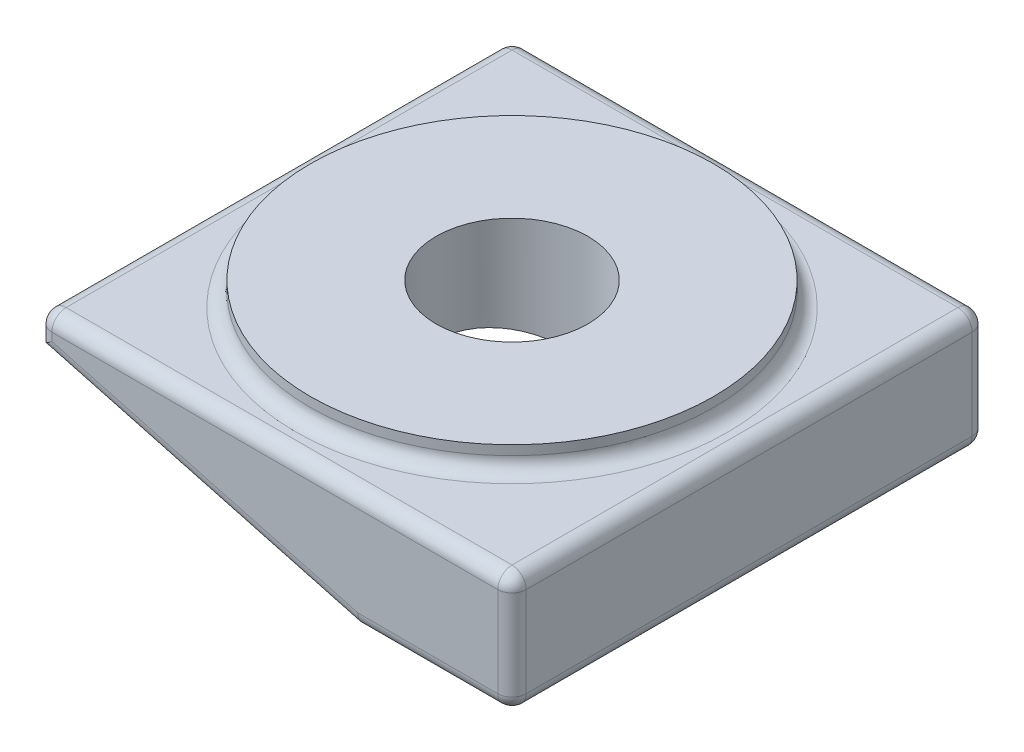
ISO-10303-21;
HEADER;
FILE_DESCRIPTION(('STEP AP214'),'2;1');
FILE_NAME('part.step','',(''),(''),'','','');
FILE_SCHEMA(('AUTOMOTIVE_DESIGN { 1 0 10303 214 1 1 1 1 }'));
ENDSEC;
DATA;
#1=APPLICATION_CONTEXT('core data for automotive mechanical design processes');
#2=APPLICATION_PROTOCOL_DEFINITION('international standard','automotive_design',2000,#1);
#3=PRODUCT_CONTEXT('',#1,'mechanical');
#4=PRODUCT('Part','Part','',(#3));
#5=PRODUCT_RELATED_PRODUCT_CATEGORY('part','',(#4));
#6=PRODUCT_DEFINITION_FORMATION('','',#4);
#7=PRODUCT_DEFINITION_CONTEXT('part definition',#1,'design');
#8=PRODUCT_DEFINITION('design','',#6,#7);
#9=PRODUCT_DEFINITION_SHAPE('','',#8);
#10=(LENGTH_UNIT() NAMED_UNIT(*) SI_UNIT(.MILLI.,.METRE.));
#11=(NAMED_UNIT(*) PLANE_ANGLE_UNIT() SI_UNIT($,.RADIAN.));
#12=(NAMED_UNIT(*) SI_UNIT($,.STERADIAN.) SOLID_ANGLE_UNIT());
#13=UNCERTAINTY_MEASURE_WITH_UNIT(LENGTH_MEASURE(1.E-05),#10,'distance_accuracy_value','');
#14=(GEOMETRIC_REPRESENTATION_CONTEXT(3) GLOBAL_UNCERTAINTY_ASSIGNED_CONTEXT((#13)) GLOBAL_UNIT_ASSIGNED_CONTEXT((#10,
#11,#12)) REPRESENTATION_CONTEXT('',''));
#15=CARTESIAN_POINT('',(0.,0.,0.));
#16=DIRECTION('',(0.,0.,1.));
#17=DIRECTION('',(1.,0.,0.));
#18=AXIS2_PLACEMENT_3D('',#15,#16,#17);
#19=CARTESIAN_POINT('',(-100.,18.,50.));
#20=DIRECTION('',(0.258819045102514,0.96592582628907,0.));
#21=DIRECTION('',(-0.96592582628907,0.258819045102514,0.));
#22=AXIS2_PLACEMENT_3D('',#19,#20,#21);
#23=PLANE('',#22);
#24=DIRECTION('',(0.,0.,-1.));
#25=VECTOR('',#24,1.);
#26=CARTESIAN_POINT('',(-32.8230854637585,0.,50.));
#27=LINE('',#26,#25);
#28=CARTESIAN_POINT('',(-32.8230854637585,0.,47.));
#29=VERTEX_POINT('',#28);
#30=CARTESIAN_POINT('',(-32.8230854637585,0.,46.));
#31=VERTEX_POINT('',#30);
#32=EDGE_CURVE('E181',#29,#31,#27,.T.);
#33=ORIENTED_EDGE('',*,*,#32,.F.);
#34=DIRECTION('',(0.96592582628907,-0.258819045102514,0.));
#35=VECTOR('',#34,1.);
#36=CARTESIAN_POINT('',(-100.,18.,47.));
#37=LINE('',#36,#35);
#38=CARTESIAN_POINT('',(-100.,18.,47.));
#39=VERTEX_POINT('',#38);
#40=EDGE_CURVE('E44',#29,#39,#37,.F.);
#41=ORIENTED_EDGE('',*,*,#40,.T.);
#42=DIRECTION('',(0.,0.,-1.));
#43=VECTOR('',#42,1.);
#44=CARTESIAN_POINT('',(-100.,18.,50.));
#45=LINE('',#44,#43);
#46=CARTESIAN_POINT('',(-100.,18.,46.));
#47=VERTEX_POINT('',#46);
#48=EDGE_CURVE('E190',#39,#47,#45,.T.);
#49=ORIENTED_EDGE('',*,*,#48,.T.);
#50=DIRECTION('',(-0.96592582628907,0.258819045102514,0.));
#51=VECTOR('',#50,1.);
#52=CARTESIAN_POINT('',(-111.308472893322,21.0300961793947,46.));
#53=LINE('',#52,#51);
#54=EDGE_CURVE('E166',#31,#47,#53,.T.);
#55=ORIENTED_EDGE('',*,*,#54,.F.);
#56=EDGE_LOOP('',(#33,#41,#49,#55));
#57=FACE_BOUND('',#56,.T.);
#58=ADVANCED_FACE('F35',(#57),#23,.F.);
#59=CARTESIAN_POINT('',(-50.,30.,0.));
#60=DIRECTION('',(0.,-1.,0.));
#61=DIRECTION('',(1.,0.,0.));
#62=AXIS2_PLACEMENT_3D('',#59,#60,#61);
#63=CYLINDRICAL_SURFACE('',#62,16.);
#64=CARTESIAN_POINT('',(-50.,30.,0.));
#65=DIRECTION('',(0.,1.,0.));
#66=DIRECTION('',(-1.,0.,0.));
#67=AXIS2_PLACEMENT_3D('',#64,#65,#66);
#68=CIRCLE('',#67,16.);
#69=CARTESIAN_POINT('',(-66.,30.,0.));
#70=VERTEX_POINT('',#69);
#71=EDGE_CURVE('E186',#70,#70,#68,.T.);
#72=ORIENTED_EDGE('',*,*,#71,.T.);
#73=EDGE_LOOP('',(#72));
#74=FACE_BOUND('',#73,.T.);
#75=CARTESIAN_POINT('',(-50.,6.67309273926437,0.));
#76=DIRECTION('',(-0.258819045102514,-0.96592582628907,0.));
#77=DIRECTION('',(0.96592582628907,-0.258819045102514,0.));
#78=AXIS2_PLACEMENT_3D('',#75,#76,#77);
#79=ELLIPSE('',#78,16.5644188865613,16.);
#80=CARTESIAN_POINT('',(-34.,2.38590566036652,0.));
#81=VERTEX_POINT('',#80);
#82=EDGE_CURVE('E193',#81,#81,#79,.T.);
#83=ORIENTED_EDGE('',*,*,#82,.T.);
#84=EDGE_LOOP('',(#83));
#85=FACE_BOUND('',#84,.T.);
#86=ADVANCED_FACE('F396',(#74,#85),#63,.F.);
#87=CARTESIAN_POINT('',(-32.8230854637585,0.,50.));
#88=DIRECTION('',(0.,1.,0.));
#89=DIRECTION('',(-1.,0.,0.));
#90=AXIS2_PLACEMENT_3D('',#87,#88,#89);
#91=PLANE('',#90);
#92=CARTESIAN_POINT('',(-32.8230854637585,0.,-46.));
#93=VERTEX_POINT('',#92);
#94=CARTESIAN_POINT('',(-32.8230854637585,0.,-47.));
#95=VERTEX_POINT('',#94);
#96=EDGE_CURVE('E172',#93,#95,#27,.T.);
#97=ORIENTED_EDGE('',*,*,#96,.T.);
#98=DIRECTION('',(1.,0.,0.));
#99=VECTOR('',#98,1.);
#100=CARTESIAN_POINT('',(-32.8230854637585,0.,-47.));
#101=LINE('',#100,#99);
#102=CARTESIAN_POINT('',(-3.,0.,-47.));
#103=VERTEX_POINT('',#102);
#104=EDGE_CURVE('E243',#95,#103,#101,.T.);
#105=ORIENTED_EDGE('',*,*,#104,.T.);
#106=DIRECTION('',(0.,0.,-1.));
#107=VECTOR('',#106,1.);
#108=CARTESIAN_POINT('',(-3.,0.,50.));
#109=LINE('',#108,#107);
#110=CARTESIAN_POINT('',(-3.,0.,47.));
#111=VERTEX_POINT('',#110);
#112=EDGE_CURVE('E241',#103,#111,#109,.F.);
#113=ORIENTED_EDGE('',*,*,#112,.T.);
#114=DIRECTION('',(1.,0.,0.));
#115=VECTOR('',#114,1.);
#116=CARTESIAN_POINT('',(-32.8230854637585,0.,47.));
#117=LINE('',#116,#115);
#118=EDGE_CURVE('E239',#111,#29,#117,.F.);
#119=ORIENTED_EDGE('',*,*,#118,.T.);
#120=ORIENTED_EDGE('',*,*,#32,.T.);
#121=DIRECTION('',(1.,0.,0.));
#122=VECTOR('',#121,1.);
#123=CARTESIAN_POINT('',(-32.8230854637585,0.,46.));
#124=LINE('',#123,#122);
#125=CARTESIAN_POINT('',(-25.0956788534457,0.,46.));
#126=VERTEX_POINT('',#125);
#127=EDGE_CURVE('E689',#31,#126,#124,.T.);
#128=ORIENTED_EDGE('',*,*,#127,.T.);
#129=DIRECTION('',(0.,0.,1.));
#130=VECTOR('',#129,1.);
#131=CARTESIAN_POINT('',(-25.0956788534457,0.,50.));
#132=LINE('',#131,#130);
#133=CARTESIAN_POINT('',(-25.0956788534457,0.,-46.));
#134=VERTEX_POINT('',#133);
#135=EDGE_CURVE('E175',#134,#126,#132,.T.);
#136=ORIENTED_EDGE('',*,*,#135,.F.);
#137=DIRECTION('',(-1.,0.,0.));
#138=VECTOR('',#137,1.);
#139=CARTESIAN_POINT('',(-32.8230854637585,0.,-46.));
#140=LINE('',#139,#138);
#141=EDGE_CURVE('E158',#134,#93,#140,.T.);
#142=ORIENTED_EDGE('',*,*,#141,.T.);
#143=EDGE_LOOP('',(#97,#105,#113,#119,#120,#128,#136,#142));
#144=FACE_BOUND('',#143,.T.);
#145=ADVANCED_FACE('F171',(#144),#91,.F.);
#146=CARTESIAN_POINT('',(0.,0.,50.));
#147=DIRECTION('',(-1.,0.,0.));
#148=DIRECTION('',(0.,0.,1.));
#149=AXIS2_PLACEMENT_3D('',#146,#147,#148);
#150=PLANE('',#149);
#151=DIRECTION('',(0.,0.,-1.));
#152=VECTOR('',#151,1.);
#153=CARTESIAN_POINT('',(0.,3.,50.));
#154=LINE('',#153,#152);
#155=CARTESIAN_POINT('',(0.,3.,47.));
#156=VERTEX_POINT('',#155);
#157=CARTESIAN_POINT('',(0.,3.,-47.));
#158=VERTEX_POINT('',#157);
#159=EDGE_CURVE('E52',#156,#158,#154,.T.);
#160=ORIENTED_EDGE('',*,*,#159,.T.);
#161=DIRECTION('',(0.,1.,0.));
#162=VECTOR('',#161,1.);
#163=CARTESIAN_POINT('',(0.,0.,-47.));
#164=LINE('',#163,#162);
#165=CARTESIAN_POINT('',(0.,22.,-47.));
#166=VERTEX_POINT('',#165);
#167=EDGE_CURVE('E249',#158,#166,#164,.T.);
#168=ORIENTED_EDGE('',*,*,#167,.T.);
#169=DIRECTION('',(0.,0.,-1.));
#170=VECTOR('',#169,1.);
#171=CARTESIAN_POINT('',(0.,22.,50.));
#172=LINE('',#171,#170);
#173=CARTESIAN_POINT('',(0.,22.,47.));
#174=VERTEX_POINT('',#173);
#175=EDGE_CURVE('E245',#166,#174,#172,.F.);
#176=ORIENTED_EDGE('',*,*,#175,.T.);
#177=DIRECTION('',(0.,1.,0.));
#178=VECTOR('',#177,1.);
#179=CARTESIAN_POINT('',(0.,0.,47.));
#180=LINE('',#179,#178);
#181=EDGE_CURVE('E57',#174,#156,#180,.F.);
#182=ORIENTED_EDGE('',*,*,#181,.T.);
#183=EDGE_LOOP('',(#160,#168,#176,#182));
#184=FACE_BOUND('',#183,.T.);
#185=ADVANCED_FACE('F417',(#184),#150,.F.);
#186=CARTESIAN_POINT('',(0.,25.,50.));
#187=DIRECTION('',(0.,-1.,0.));
#188=DIRECTION('',(1.,0.,0.));
#189=AXIS2_PLACEMENT_3D('',#186,#187,#188);
#190=PLANE('',#189);
#191=DIRECTION('',(-1.,0.,0.));
#192=VECTOR('',#191,1.);
#193=CARTESIAN_POINT('',(0.,25.,-47.));
#194=LINE('',#193,#192);
#195=CARTESIAN_POINT('',(-3.,25.,-47.));
#196=VERTEX_POINT('',#195);
#197=CARTESIAN_POINT('',(-97.,25.,-47.));
#198=VERTEX_POINT('',#197);
#199=EDGE_CURVE('E222',#196,#198,#194,.T.);
#200=ORIENTED_EDGE('',*,*,#199,.T.);
#201=DIRECTION('',(0.,0.,-1.));
#202=VECTOR('',#201,1.);
#203=CARTESIAN_POINT('',(-97.,25.,50.));
#204=LINE('',#203,#202);
#205=CARTESIAN_POINT('',(-97.,25.,47.));
#206=VERTEX_POINT('',#205);
#207=EDGE_CURVE('E224',#198,#206,#204,.F.);
#208=ORIENTED_EDGE('',*,*,#207,.T.);
#209=DIRECTION('',(-1.,0.,0.));
#210=VECTOR('',#209,1.);
#211=CARTESIAN_POINT('',(0.,25.,47.));
#212=LINE('',#211,#210);
#213=CARTESIAN_POINT('',(-3.,25.,47.));
#214=VERTEX_POINT('',#213);
#215=EDGE_CURVE('E218',#206,#214,#212,.F.);
#216=ORIENTED_EDGE('',*,*,#215,.T.);
#217=DIRECTION('',(0.,0.,-1.));
#218=VECTOR('',#217,1.);
#219=CARTESIAN_POINT('',(-3.,25.,50.));
#220=LINE('',#219,#218);
#221=EDGE_CURVE('E220',#214,#196,#220,.T.);
#222=ORIENTED_EDGE('',*,*,#221,.T.);
#223=EDGE_LOOP('',(#200,#208,#216,#222));
#224=FACE_BOUND('',#223,.T.);
#225=CARTESIAN_POINT('',(-50.,25.,0.));
#226=DIRECTION('',(0.,-1.,0.));
#227=DIRECTION('',(1.,0.,0.));
#228=AXIS2_PLACEMENT_3D('',#225,#226,#227);
#229=CIRCLE('',#228,45.5);
#230=CARTESIAN_POINT('',(-4.50000000000001,25.,0.));
#231=VERTEX_POINT('',#230);
#232=EDGE_CURVE('E215',#231,#231,#229,.T.);
#233=ORIENTED_EDGE('',*,*,#232,.T.);
#234=EDGE_LOOP('',(#233));
#235=FACE_BOUND('',#234,.T.);
#236=ADVANCED_FACE('F413',(#224,#235),#190,.F.);
#237=CARTESIAN_POINT('',(-100.,25.,50.));
#238=DIRECTION('',(1.,0.,0.));
#239=DIRECTION('',(0.,0.,-1.));
#240=AXIS2_PLACEMENT_3D('',#237,#238,#239);
#241=PLANE('',#240);
#242=ORIENTED_EDGE('',*,*,#48,.F.);
#243=DIRECTION('',(0.,-1.,0.));
#244=VECTOR('',#243,1.);
#245=CARTESIAN_POINT('',(-100.,25.,47.));
#246=LINE('',#245,#244);
#247=CARTESIAN_POINT('',(-100.,22.,47.));
#248=VERTEX_POINT('',#247);
#249=EDGE_CURVE('E212',#39,#248,#246,.F.);
#250=ORIENTED_EDGE('',*,*,#249,.T.);
#251=DIRECTION('',(0.,0.,-1.));
#252=VECTOR('',#251,1.);
#253=CARTESIAN_POINT('',(-100.,22.,50.));
#254=LINE('',#253,#252);
#255=CARTESIAN_POINT('',(-100.,22.,-47.));
#256=VERTEX_POINT('',#255);
#257=EDGE_CURVE('E210',#248,#256,#254,.T.);
#258=ORIENTED_EDGE('',*,*,#257,.T.);
#259=DIRECTION('',(0.,-1.,0.));
#260=VECTOR('',#259,1.);
#261=CARTESIAN_POINT('',(-100.,25.,-47.));
#262=LINE('',#261,#260);
#263=CARTESIAN_POINT('',(-100.,18.,-47.));
#264=VERTEX_POINT('',#263);
#265=EDGE_CURVE('E208',#256,#264,#262,.T.);
#266=ORIENTED_EDGE('',*,*,#265,.T.);
#267=CARTESIAN_POINT('',(-100.,18.,-46.));
#268=VERTEX_POINT('',#267);
#269=EDGE_CURVE('E184',#268,#264,#45,.T.);
#270=ORIENTED_EDGE('',*,*,#269,.F.);
#271=DIRECTION('',(0.,1.,0.));
#272=VECTOR('',#271,1.);
#273=CARTESIAN_POINT('',(-100.,25.,-46.));
#274=LINE('',#273,#272);
#275=CARTESIAN_POINT('',(-100.,20.0705523608202,-46.));
#276=VERTEX_POINT('',#275);
#277=EDGE_CURVE('E161',#268,#276,#274,.T.);
#278=ORIENTED_EDGE('',*,*,#277,.T.);
#279=DIRECTION('',(0.,0.,-1.));
#280=VECTOR('',#279,1.);
#281=CARTESIAN_POINT('',(-100.,20.0705523608201,50.));
#282=LINE('',#281,#280);
#283=CARTESIAN_POINT('',(-100.,20.0705523608202,46.));
#284=VERTEX_POINT('',#283);
#285=EDGE_CURVE('E196',#284,#276,#282,.T.);
#286=ORIENTED_EDGE('',*,*,#285,.F.);
#287=DIRECTION('',(0.,-1.,0.));
#288=VECTOR('',#287,1.);
#289=CARTESIAN_POINT('',(-100.,25.,46.));
#290=LINE('',#289,#288);
#291=EDGE_CURVE('E176',#284,#47,#290,.T.);
#292=ORIENTED_EDGE('',*,*,#291,.T.);
#293=EDGE_LOOP('',(#242,#250,#258,#266,#270,#278,#286,#292));
#294=FACE_BOUND('',#293,.T.);
#295=ADVANCED_FACE('F351',(#294),#241,.F.);
#296=ORIENTED_EDGE('',*,*,#269,.T.);
#297=DIRECTION('',(0.96592582628907,-0.258819045102514,0.));
#298=VECTOR('',#297,1.);
#299=CARTESIAN_POINT('',(-100.,18.,-47.));
#300=LINE('',#299,#298);
#301=EDGE_CURVE('E180',#264,#95,#300,.T.);
#302=ORIENTED_EDGE('',*,*,#301,.T.);
#303=ORIENTED_EDGE('',*,*,#96,.F.);
#304=DIRECTION('',(0.96592582628907,-0.258819045102514,0.));
#305=VECTOR('',#304,1.);
#306=CARTESIAN_POINT('',(-111.308472893322,21.0300961793947,-46.));
#307=LINE('',#306,#305);
#308=EDGE_CURVE('E154',#268,#93,#307,.T.);
#309=ORIENTED_EDGE('',*,*,#308,.F.);
#310=EDGE_LOOP('',(#296,#302,#303,#309));
#311=FACE_BOUND('',#310,.T.);
#312=ADVANCED_FACE('F178',(#311),#23,.F.);
#313=CARTESIAN_POINT('',(0.,0.,50.));
#314=DIRECTION('',(0.,0.,1.));
#315=DIRECTION('',(1.,0.,0.));
#316=AXIS2_PLACEMENT_3D('',#313,#314,#315);
#317=PLANE('',#316);
#318=DIRECTION('',(0.96592582628907,-0.258819045102514,0.));
#319=VECTOR('',#318,1.);
#320=CARTESIAN_POINT('',(-32.0466283284509,2.89777747886721,50.));
#321=LINE('',#320,#319);
#322=CARTESIAN_POINT('',(-97.,20.3019809639369,50.));
#323=VERTEX_POINT('',#322);
#324=CARTESIAN_POINT('',(-32.4281279709963,3.,50.));
#325=VERTEX_POINT('',#324);
#326=EDGE_CURVE('E204',#323,#325,#321,.T.);
#327=ORIENTED_EDGE('',*,*,#326,.T.);
#328=DIRECTION('',(1.,0.,0.));
#329=VECTOR('',#328,1.);
#330=CARTESIAN_POINT('',(0.,3.,50.));
#331=LINE('',#330,#329);
#332=CARTESIAN_POINT('',(-3.,3.,50.));
#333=VERTEX_POINT('',#332);
#334=EDGE_CURVE('E206',#325,#333,#331,.T.);
#335=ORIENTED_EDGE('',*,*,#334,.T.);
#336=DIRECTION('',(0.,1.,0.));
#337=VECTOR('',#336,1.);
#338=CARTESIAN_POINT('',(-3.,25.,50.));
#339=LINE('',#338,#337);
#340=CARTESIAN_POINT('',(-3.,22.,50.));
#341=VERTEX_POINT('',#340);
#342=EDGE_CURVE('E199',#333,#341,#339,.T.);
#343=ORIENTED_EDGE('',*,*,#342,.T.);
#344=DIRECTION('',(-1.,0.,0.));
#345=VECTOR('',#344,1.);
#346=CARTESIAN_POINT('',(-100.,22.,50.));
#347=LINE('',#346,#345);
#348=CARTESIAN_POINT('',(-97.,22.,50.));
#349=VERTEX_POINT('',#348);
#350=EDGE_CURVE('E192',#341,#349,#347,.T.);
#351=ORIENTED_EDGE('',*,*,#350,.T.);
#352=DIRECTION('',(0.,-1.,0.));
#353=VECTOR('',#352,1.);
#354=CARTESIAN_POINT('',(-97.,18.,50.));
#355=LINE('',#354,#353);
#356=EDGE_CURVE('E201',#349,#323,#355,.T.);
#357=ORIENTED_EDGE('',*,*,#356,.T.);
#358=EDGE_LOOP('',(#327,#335,#343,#351,#357));
#359=FACE_BOUND('',#358,.T.);
#360=ADVANCED_FACE('F406',(#359),#317,.T.);
#361=CARTESIAN_POINT('',(0.,0.,-50.));
#362=DIRECTION('',(0.,0.,1.));
#363=DIRECTION('',(1.,0.,0.));
#364=AXIS2_PLACEMENT_3D('',#361,#362,#363);
#365=PLANE('',#364);
#366=DIRECTION('',(0.96592582628907,-0.258819045102514,0.));
#367=VECTOR('',#366,1.);
#368=CARTESIAN_POINT('',(-1.4222726754703,-5.30799388707222,-50.));
#369=LINE('',#368,#367);
#370=CARTESIAN_POINT('',(-32.4281279709963,3.,-50.));
#371=VERTEX_POINT('',#370);
#372=CARTESIAN_POINT('',(-97.,20.3019809639369,-50.));
#373=VERTEX_POINT('',#372);
#374=EDGE_CURVE('E231',#371,#373,#369,.F.);
#375=ORIENTED_EDGE('',*,*,#374,.T.);
#376=DIRECTION('',(0.,-1.,0.));
#377=VECTOR('',#376,1.);
#378=CARTESIAN_POINT('',(-97.,0.,-50.));
#379=LINE('',#378,#377);
#380=CARTESIAN_POINT('',(-97.,22.,-50.));
#381=VERTEX_POINT('',#380);
#382=EDGE_CURVE('E235',#373,#381,#379,.F.);
#383=ORIENTED_EDGE('',*,*,#382,.T.);
#384=DIRECTION('',(-1.,0.,0.));
#385=VECTOR('',#384,1.);
#386=CARTESIAN_POINT('',(0.,22.,-50.));
#387=LINE('',#386,#385);
#388=CARTESIAN_POINT('',(-3.,22.,-50.));
#389=VERTEX_POINT('',#388);
#390=EDGE_CURVE('E233',#381,#389,#387,.F.);
#391=ORIENTED_EDGE('',*,*,#390,.T.);
#392=DIRECTION('',(0.,1.,0.));
#393=VECTOR('',#392,1.);
#394=CARTESIAN_POINT('',(-3.,0.,-50.));
#395=LINE('',#394,#393);
#396=CARTESIAN_POINT('',(-3.,3.,-50.));
#397=VERTEX_POINT('',#396);
#398=EDGE_CURVE('E227',#389,#397,#395,.F.);
#399=ORIENTED_EDGE('',*,*,#398,.T.);
#400=DIRECTION('',(1.,0.,0.));
#401=VECTOR('',#400,1.);
#402=CARTESIAN_POINT('',(0.,3.,-50.));
#403=LINE('',#402,#401);
#404=EDGE_CURVE('E229',#397,#371,#403,.F.);
#405=ORIENTED_EDGE('',*,*,#404,.T.);
#406=EDGE_LOOP('',(#375,#383,#391,#399,#405));
#407=FACE_BOUND('',#406,.T.);
#408=ADVANCED_FACE('F381',(#407),#365,.F.);
#409=CARTESIAN_POINT('',(-50.,30.,0.));
#410=DIRECTION('',(0.,1.,0.));
#411=DIRECTION('',(-1.,0.,0.));
#412=AXIS2_PLACEMENT_3D('',#409,#410,#411);
#413=PLANE('',#412);
#414=CARTESIAN_POINT('',(-50.,30.,0.));
#415=DIRECTION('',(0.,1.,0.));
#416=DIRECTION('',(-1.,0.,0.));
#417=AXIS2_PLACEMENT_3D('',#414,#415,#416);
#418=CIRCLE('',#417,42.5);
#419=CARTESIAN_POINT('',(-92.5,30.,0.));
#420=VERTEX_POINT('',#419);
#421=EDGE_CURVE('E182',#420,#420,#418,.T.);
#422=ORIENTED_EDGE('',*,*,#421,.T.);
#423=EDGE_LOOP('',(#422));
#424=FACE_BOUND('',#423,.T.);
#425=ORIENTED_EDGE('',*,*,#71,.F.);
#426=EDGE_LOOP('',(#425));
#427=FACE_BOUND('',#426,.T.);
#428=ADVANCED_FACE('F622',(#424,#427),#413,.T.);
#429=CARTESIAN_POINT('',(-50.,30.,0.));
#430=DIRECTION('',(0.,-1.,0.));
#431=DIRECTION('',(1.,0.,0.));
#432=AXIS2_PLACEMENT_3D('',#429,#430,#431);
#433=CYLINDRICAL_SURFACE('',#432,42.5);
#434=CARTESIAN_POINT('',(-50.,28.,0.));
#435=DIRECTION('',(0.,-1.,0.));
#436=DIRECTION('',(1.,0.,0.));
#437=AXIS2_PLACEMENT_3D('',#434,#435,#436);
#438=CIRCLE('',#437,42.5);
#439=CARTESIAN_POINT('',(-7.50000000000001,28.,0.));
#440=VERTEX_POINT('',#439);
#441=EDGE_CURVE('E11',#440,#440,#438,.F.);
#442=ORIENTED_EDGE('',*,*,#441,.T.);
#443=EDGE_LOOP('',(#442));
#444=FACE_BOUND('',#443,.T.);
#445=ORIENTED_EDGE('',*,*,#421,.F.);
#446=EDGE_LOOP('',(#445));
#447=FACE_BOUND('',#446,.T.);
#448=ADVANCED_FACE('F603',(#444,#447),#433,.T.);
#449=CARTESIAN_POINT('',(-110.790834803117,22.9619478319729,46.));
#450=DIRECTION('',(0.,0.,1.));
#451=DIRECTION('',(1.,0.,0.));
#452=AXIS2_PLACEMENT_3D('',#449,#450,#451);
#453=PLANE('',#452);
#454=ORIENTED_EDGE('',*,*,#54,.T.);
#455=ORIENTED_EDGE('',*,*,#291,.F.);
#456=DIRECTION('',(-0.96592582628907,0.258819045102514,0.));
#457=VECTOR('',#456,1.);
#458=CARTESIAN_POINT('',(-110.790834803117,22.9619478319729,46.));
#459=LINE('',#458,#457);
#460=EDGE_CURVE('E197',#126,#284,#459,.T.);
#461=ORIENTED_EDGE('',*,*,#460,.F.);
#462=ORIENTED_EDGE('',*,*,#127,.F.);
#463=EDGE_LOOP('',(#454,#455,#461,#462));
#464=FACE_BOUND('',#463,.T.);
#465=ADVANCED_FACE('F595',(#464),#453,.F.);
#466=CARTESIAN_POINT('',(-110.790834803117,22.9619478319729,-46.));
#467=DIRECTION('',(0.,0.,-1.));
#468=DIRECTION('',(-1.,0.,0.));
#469=AXIS2_PLACEMENT_3D('',#466,#467,#468);
#470=PLANE('',#469);
#471=DIRECTION('',(0.96592582628907,-0.258819045102514,0.));
#472=VECTOR('',#471,1.);
#473=CARTESIAN_POINT('',(-110.790834803117,22.9619478319729,-46.));
#474=LINE('',#473,#472);
#475=EDGE_CURVE('E696',#276,#134,#474,.T.);
#476=ORIENTED_EDGE('',*,*,#475,.F.);
#477=ORIENTED_EDGE('',*,*,#277,.F.);
#478=ORIENTED_EDGE('',*,*,#308,.T.);
#479=ORIENTED_EDGE('',*,*,#141,.F.);
#480=EDGE_LOOP('',(#476,#477,#478,#479));
#481=FACE_BOUND('',#480,.T.);
#482=ADVANCED_FACE('F157',(#481),#470,.F.);
#483=CARTESIAN_POINT('',(-1.68109172057281,-6.27391971336129,0.));
#484=DIRECTION('',(-0.258819045102514,-0.96592582628907,0.));
#485=DIRECTION('',(0.96592582628907,-0.258819045102514,0.));
#486=AXIS2_PLACEMENT_3D('',#483,#484,#485);
#487=PLANE('',#486);
#488=ORIENTED_EDGE('',*,*,#82,.F.);
#489=EDGE_LOOP('',(#488));
#490=FACE_BOUND('',#489,.T.);
#491=ORIENTED_EDGE('',*,*,#135,.T.);
#492=ORIENTED_EDGE('',*,*,#460,.T.);
#493=ORIENTED_EDGE('',*,*,#285,.T.);
#494=ORIENTED_EDGE('',*,*,#475,.T.);
#495=EDGE_LOOP('',(#491,#492,#493,#494));
#496=FACE_BOUND('',#495,.T.);
#497=ADVANCED_FACE('F579',(#490,#496),#487,.T.);
#498=CARTESIAN_POINT('',(-3.,0.,-47.));
#499=DIRECTION('',(0.,1.,0.));
#500=DIRECTION('',(0.,0.,1.));
#501=AXIS2_PLACEMENT_3D('',#498,#499,#500);
#502=CYLINDRICAL_SURFACE('',#501,3.);
#503=CARTESIAN_POINT('',(-3.,3.,-47.));
#504=DIRECTION('',(0.,-1.,0.));
#505=DIRECTION('',(0.,0.,-1.));
#506=AXIS2_PLACEMENT_3D('',#503,#504,#505);
#507=CIRCLE('',#506,3.);
#508=EDGE_CURVE('E305',#397,#158,#507,.T.);
#509=ORIENTED_EDGE('',*,*,#508,.F.);
#510=ORIENTED_EDGE('',*,*,#398,.F.);
#511=CARTESIAN_POINT('',(-3.,22.,-47.));
#512=DIRECTION('',(0.,1.,0.));
#513=DIRECTION('',(0.,0.,1.));
#514=AXIS2_PLACEMENT_3D('',#511,#512,#513);
#515=CIRCLE('',#514,3.);
#516=EDGE_CURVE('E307',#166,#389,#515,.T.);
#517=ORIENTED_EDGE('',*,*,#516,.F.);
#518=ORIENTED_EDGE('',*,*,#167,.F.);
#519=EDGE_LOOP('',(#509,#510,#517,#518));
#520=FACE_BOUND('',#519,.T.);
#521=ADVANCED_FACE('F383',(#520),#502,.T.);
#522=CARTESIAN_POINT('',(-32.8230854637585,3.,-47.));
#523=DIRECTION('',(1.,0.,0.));
#524=DIRECTION('',(0.,1.,0.));
#525=AXIS2_PLACEMENT_3D('',#522,#523,#524);
#526=CYLINDRICAL_SURFACE('',#525,3.);
#527=CARTESIAN_POINT('',(-3.,3.,-47.));
#528=DIRECTION('',(1.,0.,0.));
#529=DIRECTION('',(0.,0.,-1.));
#530=AXIS2_PLACEMENT_3D('',#527,#528,#529);
#531=CIRCLE('',#530,3.);
#532=EDGE_CURVE('E302',#103,#397,#531,.T.);
#533=ORIENTED_EDGE('',*,*,#532,.F.);
#534=ORIENTED_EDGE('',*,*,#104,.F.);
#535=CARTESIAN_POINT('',(-32.4281279709963,2.99999999999999,-47.));
#536=DIRECTION('',(0.991444861373811,-0.130526192220048,0.));
#537=DIRECTION('',(0.130526192220048,0.991444861373811,0.));
#538=AXIS2_PLACEMENT_3D('',#535,#536,#537);
#539=ELLIPSE('',#538,3.02588688174046,3.);
#540=EDGE_CURVE('E39',#371,#95,#539,.F.);
#541=ORIENTED_EDGE('',*,*,#540,.F.);
#542=ORIENTED_EDGE('',*,*,#404,.F.);
#543=EDGE_LOOP('',(#533,#534,#541,#542));
#544=FACE_BOUND('',#543,.T.);
#545=ADVANCED_FACE('F322',(#544),#526,.T.);
#546=CARTESIAN_POINT('',(-99.2235428646925,20.8977774788672,-47.));
#547=DIRECTION('',(0.96592582628907,-0.258819045102514,0.));
#548=DIRECTION('',(0.258819045102514,0.96592582628907,0.));
#549=AXIS2_PLACEMENT_3D('',#546,#547,#548);
#550=CYLINDRICAL_SURFACE('',#549,3.);
#551=ORIENTED_EDGE('',*,*,#540,.T.);
#552=ORIENTED_EDGE('',*,*,#301,.F.);
#553=CARTESIAN_POINT('',(-97.,20.3019809639369,-47.));
#554=DIRECTION('',(0.608761429008723,-0.793353340291233,0.));
#555=DIRECTION('',(0.793353340291233,0.608761429008723,0.));
#556=AXIS2_PLACEMENT_3D('',#553,#554,#555);
#557=ELLIPSE('',#556,3.7814172420308,3.);
#558=EDGE_CURVE('E299',#373,#264,#557,.F.);
#559=ORIENTED_EDGE('',*,*,#558,.F.);
#560=ORIENTED_EDGE('',*,*,#374,.F.);
#561=EDGE_LOOP('',(#551,#552,#559,#560));
#562=FACE_BOUND('',#561,.T.);
#563=ADVANCED_FACE('F317',(#562),#550,.T.);
#564=CARTESIAN_POINT('',(-3.,22.,-47.));
#565=DIRECTION('',(0.,0.,-1.));
#566=DIRECTION('',(-1.,0.,0.));
#567=AXIS2_PLACEMENT_3D('',#564,#565,#566);
#568=SPHERICAL_SURFACE('',#567,3.);
#569=CARTESIAN_POINT('',(-3.,22.,-47.));
#570=DIRECTION('',(0.,0.,-1.));
#571=DIRECTION('',(-1.,0.,0.));
#572=AXIS2_PLACEMENT_3D('',#569,#570,#571);
#573=CIRCLE('',#572,3.);
#574=EDGE_CURVE('E293',#166,#196,#573,.F.);
#575=ORIENTED_EDGE('',*,*,#574,.F.);
#576=ORIENTED_EDGE('',*,*,#516,.T.);
#577=CARTESIAN_POINT('',(-3.,22.,-47.));
#578=DIRECTION('',(1.,0.,0.));
#579=DIRECTION('',(0.,1.,0.));
#580=AXIS2_PLACEMENT_3D('',#577,#578,#579);
#581=CIRCLE('',#580,3.);
#582=EDGE_CURVE('E296',#196,#389,#581,.F.);
#583=ORIENTED_EDGE('',*,*,#582,.F.);
#584=EDGE_LOOP('',(#575,#576,#583));
#585=FACE_BOUND('',#584,.T.);
#586=ADVANCED_FACE('F387',(#585),#568,.T.);
#587=CARTESIAN_POINT('',(-3.,3.,-47.));
#588=DIRECTION('',(0.,0.,-1.));
#589=DIRECTION('',(-1.,0.,0.));
#590=AXIS2_PLACEMENT_3D('',#587,#588,#589);
#591=SPHERICAL_SURFACE('',#590,3.);
#592=ORIENTED_EDGE('',*,*,#532,.T.);
#593=ORIENTED_EDGE('',*,*,#508,.T.);
#594=CARTESIAN_POINT('',(-3.,3.,-47.));
#595=DIRECTION('',(0.,0.,-1.));
#596=DIRECTION('',(-1.,0.,0.));
#597=AXIS2_PLACEMENT_3D('',#594,#595,#596);
#598=CIRCLE('',#597,3.);
#599=EDGE_CURVE('E290',#103,#158,#598,.F.);
#600=ORIENTED_EDGE('',*,*,#599,.F.);
#601=EDGE_LOOP('',(#592,#593,#600));
#602=FACE_BOUND('',#601,.T.);
#603=ADVANCED_FACE('F385',(#602),#591,.T.);
#604=CARTESIAN_POINT('',(-97.,25.,-47.));
#605=DIRECTION('',(0.,-1.,0.));
#606=DIRECTION('',(0.,0.,-1.));
#607=AXIS2_PLACEMENT_3D('',#604,#605,#606);
#608=CYLINDRICAL_SURFACE('',#607,3.);
#609=ORIENTED_EDGE('',*,*,#558,.T.);
#610=ORIENTED_EDGE('',*,*,#265,.F.);
#611=CARTESIAN_POINT('',(-97.,22.,-47.));
#612=DIRECTION('',(0.,1.,0.));
#613=DIRECTION('',(0.,0.,1.));
#614=AXIS2_PLACEMENT_3D('',#611,#612,#613);
#615=CIRCLE('',#614,3.);
#616=EDGE_CURVE('E287',#381,#256,#615,.T.);
#617=ORIENTED_EDGE('',*,*,#616,.F.);
#618=ORIENTED_EDGE('',*,*,#382,.F.);
#619=EDGE_LOOP('',(#609,#610,#617,#618));
#620=FACE_BOUND('',#619,.T.);
#621=ADVANCED_FACE('F370',(#620),#608,.T.);
#622=CARTESIAN_POINT('',(0.,22.,-47.));
#623=DIRECTION('',(-1.,0.,0.));
#624=DIRECTION('',(0.,-1.,0.));
#625=AXIS2_PLACEMENT_3D('',#622,#623,#624);
#626=CYLINDRICAL_SURFACE('',#625,3.);
#627=ORIENTED_EDGE('',*,*,#582,.T.);
#628=ORIENTED_EDGE('',*,*,#390,.F.);
#629=CARTESIAN_POINT('',(-97.,22.,-47.));
#630=DIRECTION('',(-1.,0.,0.));
#631=DIRECTION('',(0.,0.,1.));
#632=AXIS2_PLACEMENT_3D('',#629,#630,#631);
#633=CIRCLE('',#632,3.);
#634=EDGE_CURVE('E285',#198,#381,#633,.T.);
#635=ORIENTED_EDGE('',*,*,#634,.F.);
#636=ORIENTED_EDGE('',*,*,#199,.F.);
#637=EDGE_LOOP('',(#627,#628,#635,#636));
#638=FACE_BOUND('',#637,.T.);
#639=ADVANCED_FACE('F378',(#638),#626,.T.);
#640=CARTESIAN_POINT('',(-3.,22.,50.));
#641=DIRECTION('',(0.,0.,-1.));
#642=DIRECTION('',(-1.,0.,0.));
#643=AXIS2_PLACEMENT_3D('',#640,#641,#642);
#644=CYLINDRICAL_SURFACE('',#643,3.);
#645=ORIENTED_EDGE('',*,*,#574,.T.);
#646=ORIENTED_EDGE('',*,*,#221,.F.);
#647=CARTESIAN_POINT('',(-3.,22.,47.));
#648=DIRECTION('',(0.,0.,1.));
#649=DIRECTION('',(1.,0.,0.));
#650=AXIS2_PLACEMENT_3D('',#647,#648,#649);
#651=CIRCLE('',#650,3.);
#652=EDGE_CURVE('E282',#174,#214,#651,.T.);
#653=ORIENTED_EDGE('',*,*,#652,.F.);
#654=ORIENTED_EDGE('',*,*,#175,.F.);
#655=EDGE_LOOP('',(#645,#646,#653,#654));
#656=FACE_BOUND('',#655,.T.);
#657=ADVANCED_FACE('F452',(#656),#644,.T.);
#658=CARTESIAN_POINT('',(-3.,0.,47.));
#659=DIRECTION('',(0.,-1.,0.));
#660=DIRECTION('',(0.,0.,-1.));
#661=AXIS2_PLACEMENT_3D('',#658,#659,#660);
#662=CYLINDRICAL_SURFACE('',#661,3.);
#663=CARTESIAN_POINT('',(-3.,3.,47.));
#664=DIRECTION('',(0.,-1.,0.));
#665=DIRECTION('',(0.,0.,-1.));
#666=AXIS2_PLACEMENT_3D('',#663,#664,#665);
#667=CIRCLE('',#666,3.);
#668=EDGE_CURVE('E276',#156,#333,#667,.T.);
#669=ORIENTED_EDGE('',*,*,#668,.F.);
#670=ORIENTED_EDGE('',*,*,#181,.F.);
#671=CARTESIAN_POINT('',(-3.,22.,47.));
#672=DIRECTION('',(0.,1.,0.));
#673=DIRECTION('',(0.,0.,1.));
#674=AXIS2_PLACEMENT_3D('',#671,#672,#673);
#675=CIRCLE('',#674,3.);
#676=EDGE_CURVE('E279',#341,#174,#675,.T.);
#677=ORIENTED_EDGE('',*,*,#676,.F.);
#678=ORIENTED_EDGE('',*,*,#342,.F.);
#679=EDGE_LOOP('',(#669,#670,#677,#678));
#680=FACE_BOUND('',#679,.T.);
#681=ADVANCED_FACE('F449',(#680),#662,.T.);
#682=CARTESIAN_POINT('',(-3.,3.,50.));
#683=DIRECTION('',(0.,0.,-1.));
#684=DIRECTION('',(-1.,0.,0.));
#685=AXIS2_PLACEMENT_3D('',#682,#683,#684);
#686=CYLINDRICAL_SURFACE('',#685,3.);
#687=ORIENTED_EDGE('',*,*,#599,.T.);
#688=ORIENTED_EDGE('',*,*,#159,.F.);
#689=CARTESIAN_POINT('',(-3.,3.,47.));
#690=DIRECTION('',(0.,0.,1.));
#691=DIRECTION('',(1.,0.,0.));
#692=AXIS2_PLACEMENT_3D('',#689,#690,#691);
#693=CIRCLE('',#692,3.);
#694=EDGE_CURVE('E273',#111,#156,#693,.T.);
#695=ORIENTED_EDGE('',*,*,#694,.F.);
#696=ORIENTED_EDGE('',*,*,#112,.F.);
#697=EDGE_LOOP('',(#687,#688,#695,#696));
#698=FACE_BOUND('',#697,.T.);
#699=ADVANCED_FACE('F331',(#698),#686,.T.);
#700=CARTESIAN_POINT('',(-97.,22.,-47.));
#701=DIRECTION('',(0.,0.,-1.));
#702=DIRECTION('',(-1.,0.,0.));
#703=AXIS2_PLACEMENT_3D('',#700,#701,#702);
#704=SPHERICAL_SURFACE('',#703,3.);
#705=ORIENTED_EDGE('',*,*,#634,.T.);
#706=ORIENTED_EDGE('',*,*,#616,.T.);
#707=CARTESIAN_POINT('',(-97.,22.,-47.));
#708=DIRECTION('',(0.,0.,-1.));
#709=DIRECTION('',(-1.,0.,0.));
#710=AXIS2_PLACEMENT_3D('',#707,#708,#709);
#711=CIRCLE('',#710,3.);
#712=EDGE_CURVE('E270',#198,#256,#711,.F.);
#713=ORIENTED_EDGE('',*,*,#712,.F.);
#714=EDGE_LOOP('',(#705,#706,#713));
#715=FACE_BOUND('',#714,.T.);
#716=ADVANCED_FACE('F374',(#715),#704,.T.);
#717=CARTESIAN_POINT('',(-3.,22.,47.));
#718=DIRECTION('',(1.,0.,0.));
#719=DIRECTION('',(0.,0.,-1.));
#720=AXIS2_PLACEMENT_3D('',#717,#718,#719);
#721=SPHERICAL_SURFACE('',#720,3.);
#722=ORIENTED_EDGE('',*,*,#676,.T.);
#723=ORIENTED_EDGE('',*,*,#652,.T.);
#724=CARTESIAN_POINT('',(-3.,22.,47.));
#725=DIRECTION('',(1.,0.,0.));
#726=DIRECTION('',(0.,1.,0.));
#727=AXIS2_PLACEMENT_3D('',#724,#725,#726);
#728=CIRCLE('',#727,3.);
#729=EDGE_CURVE('E267',#341,#214,#728,.F.);
#730=ORIENTED_EDGE('',*,*,#729,.F.);
#731=EDGE_LOOP('',(#722,#723,#730));
#732=FACE_BOUND('',#731,.T.);
#733=ADVANCED_FACE('F441',(#732),#721,.T.);
#734=CARTESIAN_POINT('',(-3.,3.,47.));
#735=DIRECTION('',(1.,0.,0.));
#736=DIRECTION('',(0.,0.,-1.));
#737=AXIS2_PLACEMENT_3D('',#734,#735,#736);
#738=SPHERICAL_SURFACE('',#737,3.);
#739=ORIENTED_EDGE('',*,*,#694,.T.);
#740=ORIENTED_EDGE('',*,*,#668,.T.);
#741=CARTESIAN_POINT('',(-3.,3.,47.));
#742=DIRECTION('',(1.,0.,0.));
#743=DIRECTION('',(0.,0.,-1.));
#744=AXIS2_PLACEMENT_3D('',#741,#742,#743);
#745=CIRCLE('',#744,3.);
#746=EDGE_CURVE('E264',#111,#333,#745,.F.);
#747=ORIENTED_EDGE('',*,*,#746,.F.);
#748=EDGE_LOOP('',(#739,#740,#747));
#749=FACE_BOUND('',#748,.T.);
#750=ADVANCED_FACE('F334',(#749),#738,.T.);
#751=CARTESIAN_POINT('',(-97.,22.,50.));
#752=DIRECTION('',(0.,0.,-1.));
#753=DIRECTION('',(-1.,0.,0.));
#754=AXIS2_PLACEMENT_3D('',#751,#752,#753);
#755=CYLINDRICAL_SURFACE('',#754,3.);
#756=ORIENTED_EDGE('',*,*,#712,.T.);
#757=ORIENTED_EDGE('',*,*,#257,.F.);
#758=CARTESIAN_POINT('',(-97.,22.,47.));
#759=DIRECTION('',(0.,0.,1.));
#760=DIRECTION('',(1.,0.,0.));
#761=AXIS2_PLACEMENT_3D('',#758,#759,#760);
#762=CIRCLE('',#761,3.);
#763=EDGE_CURVE('E261',#206,#248,#762,.T.);
#764=ORIENTED_EDGE('',*,*,#763,.F.);
#765=ORIENTED_EDGE('',*,*,#207,.F.);
#766=EDGE_LOOP('',(#756,#757,#764,#765));
#767=FACE_BOUND('',#766,.T.);
#768=ADVANCED_FACE('F365',(#767),#755,.T.);
#769=CARTESIAN_POINT('',(0.,22.,47.));
#770=DIRECTION('',(1.,0.,0.));
#771=DIRECTION('',(0.,1.,0.));
#772=AXIS2_PLACEMENT_3D('',#769,#770,#771);
#773=CYLINDRICAL_SURFACE('',#772,3.);
#774=ORIENTED_EDGE('',*,*,#729,.T.);
#775=ORIENTED_EDGE('',*,*,#215,.F.);
#776=CARTESIAN_POINT('',(-97.,22.,47.));
#777=DIRECTION('',(-1.,0.,0.));
#778=DIRECTION('',(0.,0.,1.));
#779=AXIS2_PLACEMENT_3D('',#776,#777,#778);
#780=CIRCLE('',#779,3.);
#781=EDGE_CURVE('E259',#349,#206,#780,.T.);
#782=ORIENTED_EDGE('',*,*,#781,.F.);
#783=ORIENTED_EDGE('',*,*,#350,.F.);
#784=EDGE_LOOP('',(#774,#775,#782,#783));
#785=FACE_BOUND('',#784,.T.);
#786=ADVANCED_FACE('F433',(#785),#773,.T.);
#787=CARTESIAN_POINT('',(0.,3.,47.));
#788=DIRECTION('',(-1.,0.,0.));
#789=DIRECTION('',(0.,-1.,0.));
#790=AXIS2_PLACEMENT_3D('',#787,#788,#789);
#791=CYLINDRICAL_SURFACE('',#790,3.);
#792=ORIENTED_EDGE('',*,*,#746,.T.);
#793=ORIENTED_EDGE('',*,*,#334,.F.);
#794=CARTESIAN_POINT('',(-32.4281279709963,3.,47.));
#795=DIRECTION('',(-0.991444861373811,0.130526192220048,0.));
#796=DIRECTION('',(0.130526192220048,0.991444861373811,0.));
#797=AXIS2_PLACEMENT_3D('',#794,#795,#796);
#798=ELLIPSE('',#797,3.02588688174046,3.);
#799=EDGE_CURVE('E256',#29,#325,#798,.T.);
#800=ORIENTED_EDGE('',*,*,#799,.F.);
#801=ORIENTED_EDGE('',*,*,#118,.F.);
#802=EDGE_LOOP('',(#792,#793,#800,#801));
#803=FACE_BOUND('',#802,.T.);
#804=ADVANCED_FACE('F338',(#803),#791,.T.);
#805=CARTESIAN_POINT('',(-97.,22.,47.));
#806=DIRECTION('',(0.,1.,0.));
#807=DIRECTION('',(0.,0.,1.));
#808=AXIS2_PLACEMENT_3D('',#805,#806,#807);
#809=SPHERICAL_SURFACE('',#808,3.);
#810=ORIENTED_EDGE('',*,*,#781,.T.);
#811=ORIENTED_EDGE('',*,*,#763,.T.);
#812=CARTESIAN_POINT('',(-97.,22.,47.));
#813=DIRECTION('',(0.,1.,0.));
#814=DIRECTION('',(0.,0.,1.));
#815=AXIS2_PLACEMENT_3D('',#812,#813,#814);
#816=CIRCLE('',#815,3.);
#817=EDGE_CURVE('E254',#349,#248,#816,.F.);
#818=ORIENTED_EDGE('',*,*,#817,.F.);
#819=EDGE_LOOP('',(#810,#811,#818));
#820=FACE_BOUND('',#819,.T.);
#821=ADVANCED_FACE('F360',(#820),#809,.T.);
#822=CARTESIAN_POINT('',(-1.4222726754703,-5.30799388707222,47.));
#823=DIRECTION('',(-0.96592582628907,0.258819045102514,0.));
#824=DIRECTION('',(-0.258819045102514,-0.96592582628907,0.));
#825=AXIS2_PLACEMENT_3D('',#822,#823,#824);
#826=CYLINDRICAL_SURFACE('',#825,3.);
#827=ORIENTED_EDGE('',*,*,#799,.T.);
#828=ORIENTED_EDGE('',*,*,#326,.F.);
#829=CARTESIAN_POINT('',(-97.,20.3019809639369,47.));
#830=DIRECTION('',(-0.608761429008723,0.793353340291233,0.));
#831=DIRECTION('',(-0.793353340291233,-0.608761429008723,0.));
#832=AXIS2_PLACEMENT_3D('',#829,#830,#831);
#833=ELLIPSE('',#832,3.7814172420308,3.);
#834=EDGE_CURVE('E252',#39,#323,#833,.T.);
#835=ORIENTED_EDGE('',*,*,#834,.F.);
#836=ORIENTED_EDGE('',*,*,#40,.F.);
#837=EDGE_LOOP('',(#827,#828,#835,#836));
#838=FACE_BOUND('',#837,.T.);
#839=ADVANCED_FACE('F343',(#838),#826,.T.);
#840=CARTESIAN_POINT('',(-97.,0.,47.));
#841=DIRECTION('',(0.,1.,0.));
#842=DIRECTION('',(0.,0.,1.));
#843=AXIS2_PLACEMENT_3D('',#840,#841,#842);
#844=CYLINDRICAL_SURFACE('',#843,3.);
#845=ORIENTED_EDGE('',*,*,#817,.T.);
#846=ORIENTED_EDGE('',*,*,#249,.F.);
#847=ORIENTED_EDGE('',*,*,#834,.T.);
#848=ORIENTED_EDGE('',*,*,#356,.F.);
#849=EDGE_LOOP('',(#845,#846,#847,#848));
#850=FACE_BOUND('',#849,.T.);
#851=ADVANCED_FACE('F354',(#850),#844,.T.);
#852=CARTESIAN_POINT('',(-50.,28.,0.));
#853=DIRECTION('',(0.,-1.,0.));
#854=DIRECTION('',(1.,0.,0.));
#855=AXIS2_PLACEMENT_3D('',#852,#853,#854);
#856=TOROIDAL_SURFACE('',#855,45.5,3.);
#857=ORIENTED_EDGE('',*,*,#232,.F.);
#858=EDGE_LOOP('',(#857));
#859=FACE_BOUND('',#858,.T.);
#860=ORIENTED_EDGE('',*,*,#441,.F.);
#861=EDGE_LOOP('',(#860));
#862=FACE_BOUND('',#861,.T.);
#863=ADVANCED_FACE('F37',(#859,#862),#856,.F.);
#864=CLOSED_SHELL('',(#58,#86,#145,#185,#236,#295,#312,#360,#408,#428,#448,#465,#482,#497,#521,
#545,#563,#586,#603,#621,#639,#657,#681,#699,#716,#733,#750,#768,#786,#804,#821,#839,#851,#863));
#865=MANIFOLD_SOLID_BREP('B2',#864);
#866=ADVANCED_BREP_SHAPE_REPRESENTATION('',(#18,#865),#14);
#867=SHAPE_DEFINITION_REPRESENTATION(#9,#866);
ENDSEC;
END-ISO-10303-21;
